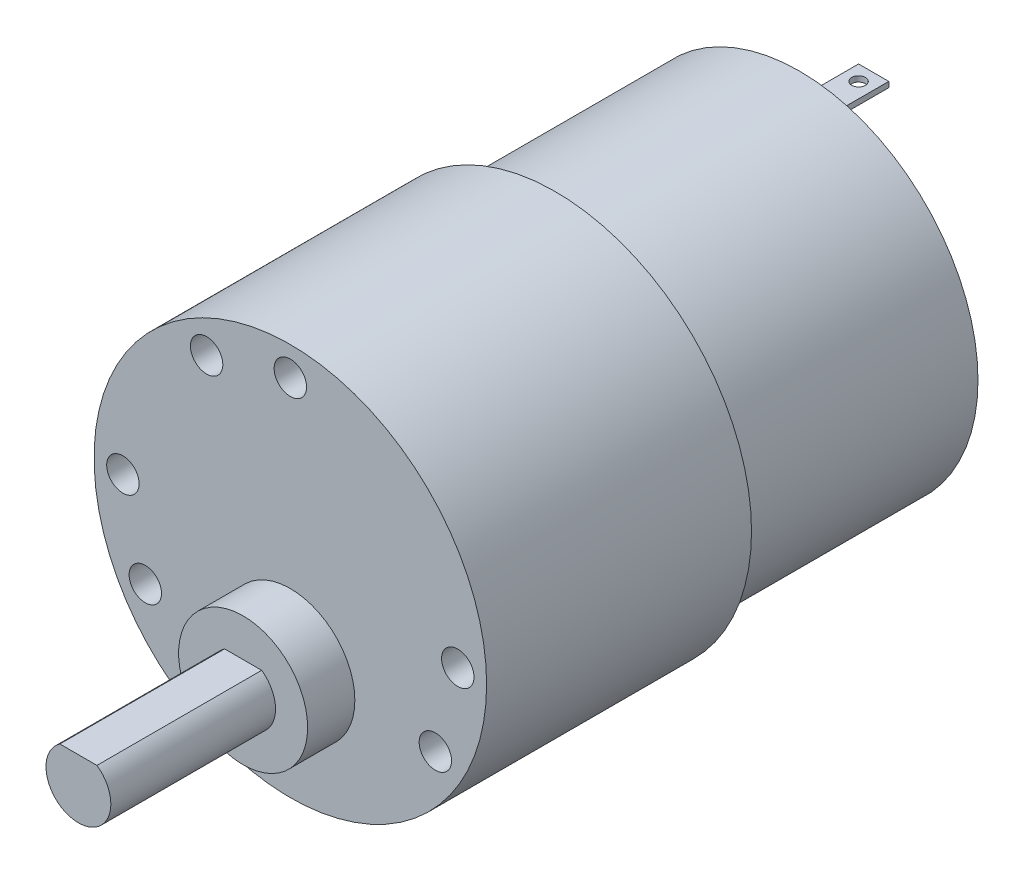
ISO-10303-21;
HEADER;
FILE_DESCRIPTION(('STEP AP214'),'2;1');
FILE_NAME('part.step','',(''),(''),'','','');
FILE_SCHEMA(('AUTOMOTIVE_DESIGN { 1 0 10303 214 1 1 1 1 }'));
ENDSEC;
DATA;
#1=APPLICATION_CONTEXT('core data for automotive mechanical design processes');
#2=APPLICATION_PROTOCOL_DEFINITION('international standard','automotive_design',2000,#1);
#3=PRODUCT_CONTEXT('',#1,'mechanical');
#4=PRODUCT('Part','Part','',(#3));
#5=PRODUCT_RELATED_PRODUCT_CATEGORY('part','',(#4));
#6=PRODUCT_DEFINITION_FORMATION('','',#4);
#7=PRODUCT_DEFINITION_CONTEXT('part definition',#1,'design');
#8=PRODUCT_DEFINITION('design','',#6,#7);
#9=PRODUCT_DEFINITION_SHAPE('','',#8);
#10=(LENGTH_UNIT() NAMED_UNIT(*) SI_UNIT(.MILLI.,.METRE.));
#11=(NAMED_UNIT(*) PLANE_ANGLE_UNIT() SI_UNIT($,.RADIAN.));
#12=(NAMED_UNIT(*) SI_UNIT($,.STERADIAN.) SOLID_ANGLE_UNIT());
#13=UNCERTAINTY_MEASURE_WITH_UNIT(LENGTH_MEASURE(1.E-05),#10,'distance_accuracy_value','');
#14=(GEOMETRIC_REPRESENTATION_CONTEXT(3) GLOBAL_UNCERTAINTY_ASSIGNED_CONTEXT((#13)) GLOBAL_UNIT_ASSIGNED_CONTEXT((#10,
#11,#12)) REPRESENTATION_CONTEXT('',''));
#15=CARTESIAN_POINT('',(0.,0.,0.));
#16=DIRECTION('',(0.,0.,1.));
#17=DIRECTION('',(1.,0.,0.));
#18=AXIS2_PLACEMENT_3D('',#15,#16,#17);
#19=CARTESIAN_POINT('',(0.,-12.7,-23.876));
#20=DIRECTION('',(0.,0.,-1.));
#21=DIRECTION('',(-1.,0.,0.));
#22=AXIS2_PLACEMENT_3D('',#19,#20,#21);
#23=PLANE('',#22);
#24=CARTESIAN_POINT('',(0.,-12.7,-23.876));
#25=DIRECTION('',(0.,0.,-1.));
#26=DIRECTION('',(-1.,0.,0.));
#27=AXIS2_PLACEMENT_3D('',#24,#25,#26);
#28=CIRCLE('',#27,2.413);
#29=CARTESIAN_POINT('',(-2.413,-12.7,-23.876));
#30=VERTEX_POINT('',#29);
#31=EDGE_CURVE('E278',#30,#30,#28,.T.);
#32=ORIENTED_EDGE('',*,*,#31,.T.);
#33=EDGE_LOOP('',(#32));
#34=FACE_BOUND('',#33,.T.);
#35=DIRECTION('',(-1.,0.,0.));
#36=VECTOR('',#35,1.);
#37=CARTESIAN_POINT('',(-1.397,-12.446,-23.876));
#38=LINE('',#37,#36);
#39=CARTESIAN_POINT('',(1.397,-12.446,-23.876));
#40=VERTEX_POINT('',#39);
#41=CARTESIAN_POINT('',(-1.397,-12.446,-23.876));
#42=VERTEX_POINT('',#41);
#43=EDGE_CURVE('E48',#40,#42,#38,.T.);
#44=ORIENTED_EDGE('',*,*,#43,.T.);
#45=DIRECTION('',(0.,1.,0.));
#46=VECTOR('',#45,1.);
#47=CARTESIAN_POINT('',(-1.397,-12.954,-23.876));
#48=LINE('',#47,#46);
#49=CARTESIAN_POINT('',(-1.397,-12.954,-23.876));
#50=VERTEX_POINT('',#49);
#51=EDGE_CURVE('E213',#50,#42,#48,.T.);
#52=ORIENTED_EDGE('',*,*,#51,.F.);
#53=DIRECTION('',(-1.,0.,0.));
#54=VECTOR('',#53,1.);
#55=CARTESIAN_POINT('',(-1.397,-12.954,-23.876));
#56=LINE('',#55,#54);
#57=CARTESIAN_POINT('',(1.397,-12.954,-23.876));
#58=VERTEX_POINT('',#57);
#59=EDGE_CURVE('E188',#58,#50,#56,.T.);
#60=ORIENTED_EDGE('',*,*,#59,.F.);
#61=DIRECTION('',(0.,1.,0.));
#62=VECTOR('',#61,1.);
#63=CARTESIAN_POINT('',(1.397,-12.954,-23.876));
#64=LINE('',#63,#62);
#65=EDGE_CURVE('E198',#58,#40,#64,.T.);
#66=ORIENTED_EDGE('',*,*,#65,.T.);
#67=EDGE_LOOP('',(#44,#52,#60,#66));
#68=FACE_BOUND('',#67,.T.);
#69=ADVANCED_FACE('F33',(#34,#68),#23,.T.);
#70=CARTESIAN_POINT('',(0.,12.7,-23.876));
#71=DIRECTION('',(0.,0.,-1.));
#72=DIRECTION('',(-1.,0.,0.));
#73=AXIS2_PLACEMENT_3D('',#70,#71,#72);
#74=PLANE('',#73);
#75=CARTESIAN_POINT('',(0.,12.7,-23.876));
#76=DIRECTION('',(0.,0.,-1.));
#77=DIRECTION('',(-1.,0.,0.));
#78=AXIS2_PLACEMENT_3D('',#75,#76,#77);
#79=CIRCLE('',#78,2.413);
#80=CARTESIAN_POINT('',(-2.413,12.7,-23.876));
#81=VERTEX_POINT('',#80);
#82=EDGE_CURVE('E272',#81,#81,#79,.T.);
#83=ORIENTED_EDGE('',*,*,#82,.T.);
#84=EDGE_LOOP('',(#83));
#85=FACE_BOUND('',#84,.T.);
#86=DIRECTION('',(1.,0.,0.));
#87=VECTOR('',#86,1.);
#88=CARTESIAN_POINT('',(1.397,12.446,-23.876));
#89=LINE('',#88,#87);
#90=CARTESIAN_POINT('',(-1.397,12.446,-23.876));
#91=VERTEX_POINT('',#90);
#92=CARTESIAN_POINT('',(1.397,12.446,-23.876));
#93=VERTEX_POINT('',#92);
#94=EDGE_CURVE('E56',#91,#93,#89,.T.);
#95=ORIENTED_EDGE('',*,*,#94,.T.);
#96=DIRECTION('',(0.,-1.,0.));
#97=VECTOR('',#96,1.);
#98=CARTESIAN_POINT('',(1.397,12.954,-23.876));
#99=LINE('',#98,#97);
#100=CARTESIAN_POINT('',(1.397,12.954,-23.876));
#101=VERTEX_POINT('',#100);
#102=EDGE_CURVE('E247',#101,#93,#99,.T.);
#103=ORIENTED_EDGE('',*,*,#102,.F.);
#104=DIRECTION('',(1.,0.,0.));
#105=VECTOR('',#104,1.);
#106=CARTESIAN_POINT('',(1.397,12.954,-23.876));
#107=LINE('',#106,#105);
#108=CARTESIAN_POINT('',(-1.397,12.954,-23.876));
#109=VERTEX_POINT('',#108);
#110=EDGE_CURVE('E222',#109,#101,#107,.T.);
#111=ORIENTED_EDGE('',*,*,#110,.F.);
#112=DIRECTION('',(0.,-1.,0.));
#113=VECTOR('',#112,1.);
#114=CARTESIAN_POINT('',(-1.397,12.954,-23.876));
#115=LINE('',#114,#113);
#116=EDGE_CURVE('E232',#109,#91,#115,.T.);
#117=ORIENTED_EDGE('',*,*,#116,.T.);
#118=EDGE_LOOP('',(#95,#103,#111,#117));
#119=FACE_BOUND('',#118,.T.);
#120=ADVANCED_FACE('F321',(#85,#119),#74,.T.);
#121=CARTESIAN_POINT('',(0.,-7.366,28.8798));
#122=DIRECTION('',(0.,0.,1.));
#123=DIRECTION('',(1.,0.,0.));
#124=AXIS2_PLACEMENT_3D('',#121,#122,#123);
#125=PLANE('',#124);
#126=CARTESIAN_POINT('',(0.,-7.366,28.8798));
#127=DIRECTION('',(0.,0.,1.));
#128=DIRECTION('',(1.,0.,0.));
#129=AXIS2_PLACEMENT_3D('',#126,#127,#128);
#130=CIRCLE('',#129,5.969);
#131=CARTESIAN_POINT('',(5.969,-7.366,28.8798));
#132=VERTEX_POINT('',#131);
#133=EDGE_CURVE('E266',#132,#132,#130,.T.);
#134=ORIENTED_EDGE('',*,*,#133,.T.);
#135=EDGE_LOOP('',(#134));
#136=FACE_BOUND('',#135,.T.);
#137=DIRECTION('',(-1.,0.,0.));
#138=VECTOR('',#137,1.);
#139=CARTESIAN_POINT('',(-1.71565701700544,-4.905,28.8798));
#140=LINE('',#139,#138);
#141=CARTESIAN_POINT('',(1.71565701700544,-4.905,28.8798));
#142=VERTEX_POINT('',#141);
#143=CARTESIAN_POINT('',(-1.71565701700544,-4.905,28.8798));
#144=VERTEX_POINT('',#143);
#145=EDGE_CURVE('E255',#142,#144,#140,.T.);
#146=ORIENTED_EDGE('',*,*,#145,.F.);
#147=CARTESIAN_POINT('',(0.,-7.366,28.8798));
#148=DIRECTION('',(0.,0.,1.));
#149=DIRECTION('',(1.,0.,0.));
#150=AXIS2_PLACEMENT_3D('',#147,#148,#149);
#151=CIRCLE('',#150,3.);
#152=EDGE_CURVE('E250',#144,#142,#151,.T.);
#153=ORIENTED_EDGE('',*,*,#152,.F.);
#154=EDGE_LOOP('',(#146,#153));
#155=FACE_BOUND('',#154,.T.);
#156=ADVANCED_FACE('F327',(#136,#155),#125,.T.);
#157=CARTESIAN_POINT('',(0.,0.,24.511));
#158=DIRECTION('',(0.,0.,1.));
#159=DIRECTION('',(1.,0.,0.));
#160=AXIS2_PLACEMENT_3D('',#157,#158,#159);
#161=PLANE('',#160);
#162=CARTESIAN_POINT('',(-7.74699999999983,13.4181976062362,24.511));
#163=DIRECTION('',(0.,0.,1.));
#164=DIRECTION('',(1.,0.,0.));
#165=AXIS2_PLACEMENT_3D('',#162,#163,#164);
#166=CIRCLE('',#165,1.49999999999999);
#167=CARTESIAN_POINT('',(-6.24699999999984,13.4181976062362,24.511));
#168=VERTEX_POINT('',#167);
#169=EDGE_CURVE('E142',#168,#168,#166,.T.);
#170=ORIENTED_EDGE('',*,*,#169,.F.);
#171=EDGE_LOOP('',(#170));
#172=FACE_BOUND('',#171,.T.);
#173=CARTESIAN_POINT('',(-15.494,1.62291035592107E-13,24.511));
#174=DIRECTION('',(0.,0.,1.));
#175=DIRECTION('',(1.,0.,0.));
#176=AXIS2_PLACEMENT_3D('',#173,#174,#175);
#177=CIRCLE('',#176,1.49999999999999);
#178=CARTESIAN_POINT('',(-13.994,1.62291035592107E-13,24.511));
#179=VERTEX_POINT('',#178);
#180=EDGE_CURVE('E141',#179,#179,#177,.T.);
#181=ORIENTED_EDGE('',*,*,#180,.F.);
#182=EDGE_LOOP('',(#181));
#183=FACE_BOUND('',#182,.T.);
#184=CARTESIAN_POINT('',(-13.4181976062362,-7.74699999999987,24.511));
#185=DIRECTION('',(0.,0.,1.));
#186=DIRECTION('',(1.,0.,0.));
#187=AXIS2_PLACEMENT_3D('',#184,#185,#186);
#188=CIRCLE('',#187,1.49999999999999);
#189=CARTESIAN_POINT('',(-11.9181976062362,-7.74699999999987,24.511));
#190=VERTEX_POINT('',#189);
#191=EDGE_CURVE('E152',#190,#190,#188,.T.);
#192=ORIENTED_EDGE('',*,*,#191,.F.);
#193=EDGE_LOOP('',(#192));
#194=FACE_BOUND('',#193,.T.);
#195=CARTESIAN_POINT('',(-7.74700000000011,-13.418197606236,24.511));
#196=DIRECTION('',(0.,0.,1.));
#197=DIRECTION('',(1.,0.,0.));
#198=AXIS2_PLACEMENT_3D('',#195,#196,#197);
#199=CIRCLE('',#198,1.49999999999999);
#200=CARTESIAN_POINT('',(-6.24700000000012,-13.418197606236,24.511));
#201=VERTEX_POINT('',#200);
#202=EDGE_CURVE('E158',#201,#201,#199,.T.);
#203=ORIENTED_EDGE('',*,*,#202,.F.);
#204=EDGE_LOOP('',(#203));
#205=FACE_BOUND('',#204,.T.);
#206=CARTESIAN_POINT('',(13.4181976062361,-7.74700000000006,24.511));
#207=DIRECTION('',(0.,0.,1.));
#208=DIRECTION('',(1.,0.,0.));
#209=AXIS2_PLACEMENT_3D('',#206,#207,#208);
#210=CIRCLE('',#209,1.49999999999999);
#211=CARTESIAN_POINT('',(14.918197606236,-7.74700000000006,24.511));
#212=VERTEX_POINT('',#211);
#213=EDGE_CURVE('E164',#212,#212,#210,.T.);
#214=ORIENTED_EDGE('',*,*,#213,.F.);
#215=EDGE_LOOP('',(#214));
#216=FACE_BOUND('',#215,.T.);
#217=CARTESIAN_POINT('',(15.494,0.,24.511));
#218=DIRECTION('',(0.,0.,1.));
#219=DIRECTION('',(1.,0.,0.));
#220=AXIS2_PLACEMENT_3D('',#217,#218,#219);
#221=CIRCLE('',#220,1.49999999999999);
#222=CARTESIAN_POINT('',(16.994,0.,24.511));
#223=VERTEX_POINT('',#222);
#224=EDGE_CURVE('E170',#223,#223,#221,.T.);
#225=ORIENTED_EDGE('',*,*,#224,.F.);
#226=EDGE_LOOP('',(#225));
#227=FACE_BOUND('',#226,.T.);
#228=CARTESIAN_POINT('',(0.,15.494,24.511));
#229=DIRECTION('',(0.,0.,1.));
#230=DIRECTION('',(1.,0.,0.));
#231=AXIS2_PLACEMENT_3D('',#228,#229,#230);
#232=CIRCLE('',#231,1.49999999999999);
#233=CARTESIAN_POINT('',(1.49999999999999,15.494,24.511));
#234=VERTEX_POINT('',#233);
#235=EDGE_CURVE('E176',#234,#234,#232,.T.);
#236=ORIENTED_EDGE('',*,*,#235,.F.);
#237=EDGE_LOOP('',(#236));
#238=FACE_BOUND('',#237,.T.);
#239=CARTESIAN_POINT('',(0.,0.,24.511));
#240=DIRECTION('',(0.,0.,1.));
#241=DIRECTION('',(1.,0.,0.));
#242=AXIS2_PLACEMENT_3D('',#239,#240,#241);
#243=CIRCLE('',#242,18.161);
#244=CARTESIAN_POINT('',(18.161,0.,24.511));
#245=VERTEX_POINT('',#244);
#246=EDGE_CURVE('E41',#245,#245,#243,.T.);
#247=ORIENTED_EDGE('',*,*,#246,.T.);
#248=EDGE_LOOP('',(#247));
#249=FACE_BOUND('',#248,.T.);
#250=CARTESIAN_POINT('',(0.,-7.366,24.511));
#251=DIRECTION('',(0.,0.,1.));
#252=DIRECTION('',(1.,0.,0.));
#253=AXIS2_PLACEMENT_3D('',#250,#251,#252);
#254=CIRCLE('',#253,5.969);
#255=CARTESIAN_POINT('',(5.969,-7.366,24.511));
#256=VERTEX_POINT('',#255);
#257=EDGE_CURVE('E265',#256,#256,#254,.T.);
#258=ORIENTED_EDGE('',*,*,#257,.F.);
#259=EDGE_LOOP('',(#258));
#260=FACE_BOUND('',#259,.T.);
#261=ADVANCED_FACE('F341',(#172,#183,#194,#205,#216,#227,#238,#249,#260),#161,.T.);
#262=CARTESIAN_POINT('',(0.,0.,-22.606));
#263=DIRECTION('',(0.,0.,-1.));
#264=DIRECTION('',(-1.,0.,0.));
#265=AXIS2_PLACEMENT_3D('',#262,#263,#264);
#266=PLANE('',#265);
#267=CARTESIAN_POINT('',(0.,-12.7,-22.606));
#268=DIRECTION('',(0.,0.,-1.));
#269=DIRECTION('',(-1.,0.,0.));
#270=AXIS2_PLACEMENT_3D('',#267,#268,#269);
#271=CIRCLE('',#270,2.413);
#272=CARTESIAN_POINT('',(-2.413,-12.7,-22.606));
#273=VERTEX_POINT('',#272);
#274=EDGE_CURVE('E275',#273,#273,#271,.T.);
#275=ORIENTED_EDGE('',*,*,#274,.F.);
#276=EDGE_LOOP('',(#275));
#277=FACE_BOUND('',#276,.T.);
#278=CARTESIAN_POINT('',(0.,0.,-22.606));
#279=DIRECTION('',(0.,0.,-1.));
#280=DIRECTION('',(-1.,0.,0.));
#281=AXIS2_PLACEMENT_3D('',#278,#279,#280);
#282=CIRCLE('',#281,16.51);
#283=CARTESIAN_POINT('',(-16.51,0.,-22.606));
#284=VERTEX_POINT('',#283);
#285=EDGE_CURVE('E287',#284,#284,#282,.T.);
#286=ORIENTED_EDGE('',*,*,#285,.T.);
#287=EDGE_LOOP('',(#286));
#288=FACE_BOUND('',#287,.T.);
#289=CARTESIAN_POINT('',(0.,0.,-22.606));
#290=DIRECTION('',(0.,0.,-1.));
#291=DIRECTION('',(-1.,0.,0.));
#292=AXIS2_PLACEMENT_3D('',#289,#290,#291);
#293=CIRCLE('',#292,4.5085);
#294=CARTESIAN_POINT('',(-4.5085,0.,-22.606));
#295=VERTEX_POINT('',#294);
#296=EDGE_CURVE('E281',#295,#295,#293,.T.);
#297=ORIENTED_EDGE('',*,*,#296,.F.);
#298=EDGE_LOOP('',(#297));
#299=FACE_BOUND('',#298,.T.);
#300=CARTESIAN_POINT('',(0.,12.7,-22.606));
#301=DIRECTION('',(0.,0.,-1.));
#302=DIRECTION('',(-1.,0.,0.));
#303=AXIS2_PLACEMENT_3D('',#300,#301,#302);
#304=CIRCLE('',#303,2.413);
#305=CARTESIAN_POINT('',(-2.413,12.7,-22.606));
#306=VERTEX_POINT('',#305);
#307=EDGE_CURVE('E269',#306,#306,#304,.T.);
#308=ORIENTED_EDGE('',*,*,#307,.F.);
#309=EDGE_LOOP('',(#308));
#310=FACE_BOUND('',#309,.T.);
#311=ADVANCED_FACE('F301',(#277,#288,#299,#310),#266,.T.);
#312=CARTESIAN_POINT('',(0.,0.,0.));
#313=DIRECTION('',(0.,0.,1.));
#314=DIRECTION('',(1.,0.,0.));
#315=AXIS2_PLACEMENT_3D('',#312,#313,#314);
#316=PLANE('',#315);
#317=CARTESIAN_POINT('',(0.,0.,0.));
#318=DIRECTION('',(0.,0.,1.));
#319=DIRECTION('',(1.,0.,0.));
#320=AXIS2_PLACEMENT_3D('',#317,#318,#319);
#321=CIRCLE('',#320,18.161);
#322=CARTESIAN_POINT('',(18.161,0.,0.));
#323=VERTEX_POINT('',#322);
#324=EDGE_CURVE('E292',#323,#323,#321,.T.);
#325=ORIENTED_EDGE('',*,*,#324,.F.);
#326=EDGE_LOOP('',(#325));
#327=FACE_BOUND('',#326,.T.);
#328=CARTESIAN_POINT('',(0.,0.,0.));
#329=DIRECTION('',(0.,0.,1.));
#330=DIRECTION('',(1.,0.,0.));
#331=AXIS2_PLACEMENT_3D('',#328,#329,#330);
#332=CIRCLE('',#331,16.51);
#333=CARTESIAN_POINT('',(16.51,0.,0.));
#334=VERTEX_POINT('',#333);
#335=EDGE_CURVE('E11',#334,#334,#332,.F.);
#336=ORIENTED_EDGE('',*,*,#335,.F.);
#337=EDGE_LOOP('',(#336));
#338=FACE_BOUND('',#337,.T.);
#339=ADVANCED_FACE('F298',(#327,#338),#316,.F.);
#340=CARTESIAN_POINT('',(0.,0.,24.511));
#341=DIRECTION('',(0.,0.,-1.));
#342=DIRECTION('',(-1.,0.,0.));
#343=AXIS2_PLACEMENT_3D('',#340,#341,#342);
#344=CYLINDRICAL_SURFACE('',#343,18.161);
#345=ORIENTED_EDGE('',*,*,#246,.F.);
#346=EDGE_LOOP('',(#345));
#347=FACE_BOUND('',#346,.T.);
#348=ORIENTED_EDGE('',*,*,#324,.T.);
#349=EDGE_LOOP('',(#348));
#350=FACE_BOUND('',#349,.T.);
#351=ADVANCED_FACE('F35',(#347,#350),#344,.T.);
#352=CARTESIAN_POINT('',(0.,0.,-22.606));
#353=DIRECTION('',(0.,0.,1.));
#354=DIRECTION('',(1.,0.,0.));
#355=AXIS2_PLACEMENT_3D('',#352,#353,#354);
#356=CYLINDRICAL_SURFACE('',#355,16.51);
#357=ORIENTED_EDGE('',*,*,#285,.F.);
#358=EDGE_LOOP('',(#357));
#359=FACE_BOUND('',#358,.T.);
#360=ORIENTED_EDGE('',*,*,#335,.T.);
#361=EDGE_LOOP('',(#360));
#362=FACE_BOUND('',#361,.T.);
#363=ADVANCED_FACE('F304',(#359,#362),#356,.T.);
#364=CARTESIAN_POINT('',(0.,0.,-25.908));
#365=DIRECTION('',(0.,0.,1.));
#366=DIRECTION('',(1.,0.,0.));
#367=AXIS2_PLACEMENT_3D('',#364,#365,#366);
#368=CYLINDRICAL_SURFACE('',#367,4.5085);
#369=CARTESIAN_POINT('',(0.,0.,-25.908));
#370=DIRECTION('',(0.,0.,-1.));
#371=DIRECTION('',(-1.,0.,0.));
#372=AXIS2_PLACEMENT_3D('',#369,#370,#371);
#373=CIRCLE('',#372,4.5085);
#374=CARTESIAN_POINT('',(-4.5085,0.,-25.908));
#375=VERTEX_POINT('',#374);
#376=EDGE_CURVE('E284',#375,#375,#373,.T.);
#377=ORIENTED_EDGE('',*,*,#376,.F.);
#378=EDGE_LOOP('',(#377));
#379=FACE_BOUND('',#378,.T.);
#380=ORIENTED_EDGE('',*,*,#296,.T.);
#381=EDGE_LOOP('',(#380));
#382=FACE_BOUND('',#381,.T.);
#383=ADVANCED_FACE('F306',(#379,#382),#368,.T.);
#384=CARTESIAN_POINT('',(0.,0.,-25.908));
#385=DIRECTION('',(0.,0.,-1.));
#386=DIRECTION('',(-1.,0.,0.));
#387=AXIS2_PLACEMENT_3D('',#384,#385,#386);
#388=PLANE('',#387);
#389=ORIENTED_EDGE('',*,*,#376,.T.);
#390=EDGE_LOOP('',(#389));
#391=FACE_BOUND('',#390,.T.);
#392=ADVANCED_FACE('F313',(#391),#388,.T.);
#393=CARTESIAN_POINT('',(0.,-12.7,-23.876));
#394=DIRECTION('',(0.,0.,1.));
#395=DIRECTION('',(1.,0.,0.));
#396=AXIS2_PLACEMENT_3D('',#393,#394,#395);
#397=CYLINDRICAL_SURFACE('',#396,2.413);
#398=ORIENTED_EDGE('',*,*,#31,.F.);
#399=EDGE_LOOP('',(#398));
#400=FACE_BOUND('',#399,.T.);
#401=ORIENTED_EDGE('',*,*,#274,.T.);
#402=EDGE_LOOP('',(#401));
#403=FACE_BOUND('',#402,.T.);
#404=ADVANCED_FACE('F334',(#400,#403),#397,.T.);
#405=CARTESIAN_POINT('',(0.,12.7,-23.876));
#406=DIRECTION('',(0.,0.,1.));
#407=DIRECTION('',(1.,0.,0.));
#408=AXIS2_PLACEMENT_3D('',#405,#406,#407);
#409=CYLINDRICAL_SURFACE('',#408,2.413);
#410=ORIENTED_EDGE('',*,*,#82,.F.);
#411=EDGE_LOOP('',(#410));
#412=FACE_BOUND('',#411,.T.);
#413=ORIENTED_EDGE('',*,*,#307,.T.);
#414=EDGE_LOOP('',(#413));
#415=FACE_BOUND('',#414,.T.);
#416=ADVANCED_FACE('F333',(#412,#415),#409,.T.);
#417=CARTESIAN_POINT('',(0.,-7.366,28.8798));
#418=DIRECTION('',(0.,0.,-1.));
#419=DIRECTION('',(-1.,0.,0.));
#420=AXIS2_PLACEMENT_3D('',#417,#418,#419);
#421=CYLINDRICAL_SURFACE('',#420,5.969);
#422=ORIENTED_EDGE('',*,*,#133,.F.);
#423=EDGE_LOOP('',(#422));
#424=FACE_BOUND('',#423,.T.);
#425=ORIENTED_EDGE('',*,*,#257,.T.);
#426=EDGE_LOOP('',(#425));
#427=FACE_BOUND('',#426,.T.);
#428=ADVANCED_FACE('F355',(#424,#427),#421,.T.);
#429=CARTESIAN_POINT('',(0.,-7.366,44.1198));
#430=DIRECTION('',(0.,0.,-1.));
#431=DIRECTION('',(-1.,0.,0.));
#432=AXIS2_PLACEMENT_3D('',#429,#430,#431);
#433=CYLINDRICAL_SURFACE('',#432,3.);
#434=ORIENTED_EDGE('',*,*,#152,.T.);
#435=DIRECTION('',(0.,0.,-1.));
#436=VECTOR('',#435,1.);
#437=CARTESIAN_POINT('',(1.71565701700544,-4.905,44.1198));
#438=LINE('',#437,#436);
#439=CARTESIAN_POINT('',(1.71565701700544,-4.905,44.1198));
#440=VERTEX_POINT('',#439);
#441=EDGE_CURVE('E262',#440,#142,#438,.T.);
#442=ORIENTED_EDGE('',*,*,#441,.F.);
#443=CARTESIAN_POINT('',(0.,-7.366,44.1198));
#444=DIRECTION('',(0.,0.,1.));
#445=DIRECTION('',(1.,0.,0.));
#446=AXIS2_PLACEMENT_3D('',#443,#444,#445);
#447=CIRCLE('',#446,3.);
#448=CARTESIAN_POINT('',(-1.71565701700544,-4.905,44.1198));
#449=VERTEX_POINT('',#448);
#450=EDGE_CURVE('E251',#449,#440,#447,.T.);
#451=ORIENTED_EDGE('',*,*,#450,.F.);
#452=DIRECTION('',(0.,0.,-1.));
#453=VECTOR('',#452,1.);
#454=CARTESIAN_POINT('',(-1.71565701700544,-4.905,44.1198));
#455=LINE('',#454,#453);
#456=EDGE_CURVE('E257',#449,#144,#455,.T.);
#457=ORIENTED_EDGE('',*,*,#456,.T.);
#458=EDGE_LOOP('',(#434,#442,#451,#457));
#459=FACE_BOUND('',#458,.T.);
#460=ADVANCED_FACE('F360',(#459),#433,.T.);
#461=CARTESIAN_POINT('',(-1.71565701700544,-4.905,44.1198));
#462=DIRECTION('',(0.,-1.,0.));
#463=DIRECTION('',(0.,0.,-1.));
#464=AXIS2_PLACEMENT_3D('',#461,#462,#463);
#465=PLANE('',#464);
#466=ORIENTED_EDGE('',*,*,#145,.T.);
#467=ORIENTED_EDGE('',*,*,#456,.F.);
#468=DIRECTION('',(-1.,0.,0.));
#469=VECTOR('',#468,1.);
#470=CARTESIAN_POINT('',(-1.71565701700544,-4.905,44.1198));
#471=LINE('',#470,#469);
#472=EDGE_CURVE('E254',#440,#449,#471,.T.);
#473=ORIENTED_EDGE('',*,*,#472,.F.);
#474=ORIENTED_EDGE('',*,*,#441,.T.);
#475=EDGE_LOOP('',(#466,#467,#473,#474));
#476=FACE_BOUND('',#475,.T.);
#477=ADVANCED_FACE('F408',(#476),#465,.F.);
#478=CARTESIAN_POINT('',(0.,-7.366,44.1198));
#479=DIRECTION('',(0.,0.,1.));
#480=DIRECTION('',(1.,0.,0.));
#481=AXIS2_PLACEMENT_3D('',#478,#479,#480);
#482=PLANE('',#481);
#483=ORIENTED_EDGE('',*,*,#450,.T.);
#484=ORIENTED_EDGE('',*,*,#472,.T.);
#485=EDGE_LOOP('',(#483,#484));
#486=FACE_BOUND('',#485,.T.);
#487=ADVANCED_FACE('F385',(#486),#482,.T.);
#488=CARTESIAN_POINT('',(0.,12.954,0.));
#489=DIRECTION('',(0.,-1.,0.));
#490=DIRECTION('',(0.,0.,-1.));
#491=AXIS2_PLACEMENT_3D('',#488,#489,#490);
#492=PLANE('',#491);
#493=ORIENTED_EDGE('',*,*,#110,.T.);
#494=DIRECTION('',(0.,0.,-1.));
#495=VECTOR('',#494,1.);
#496=CARTESIAN_POINT('',(1.397,12.954,-23.876));
#497=LINE('',#496,#495);
#498=CARTESIAN_POINT('',(1.397,12.954,-29.464));
#499=VERTEX_POINT('',#498);
#500=EDGE_CURVE('E225',#101,#499,#497,.T.);
#501=ORIENTED_EDGE('',*,*,#500,.T.);
#502=DIRECTION('',(-1.,0.,0.));
#503=VECTOR('',#502,1.);
#504=CARTESIAN_POINT('',(1.397,12.954,-29.464));
#505=LINE('',#504,#503);
#506=CARTESIAN_POINT('',(-1.397,12.954,-29.464));
#507=VERTEX_POINT('',#506);
#508=EDGE_CURVE('E228',#499,#507,#505,.T.);
#509=ORIENTED_EDGE('',*,*,#508,.T.);
#510=DIRECTION('',(0.,0.,1.));
#511=VECTOR('',#510,1.);
#512=CARTESIAN_POINT('',(-1.397,12.954,-23.876));
#513=LINE('',#512,#511);
#514=EDGE_CURVE('E230',#507,#109,#513,.T.);
#515=ORIENTED_EDGE('',*,*,#514,.T.);
#516=EDGE_LOOP('',(#493,#501,#509,#515));
#517=FACE_BOUND('',#516,.T.);
#518=CARTESIAN_POINT('',(0.,12.954,-28.067));
#519=DIRECTION('',(0.,1.,0.));
#520=DIRECTION('',(0.,0.,1.));
#521=AXIS2_PLACEMENT_3D('',#518,#519,#520);
#522=CIRCLE('',#521,0.634999999999999);
#523=CARTESIAN_POINT('',(0.,12.954,-27.432));
#524=VERTEX_POINT('',#523);
#525=EDGE_CURVE('E217',#524,#524,#522,.T.);
#526=ORIENTED_EDGE('',*,*,#525,.F.);
#527=EDGE_LOOP('',(#526));
#528=FACE_BOUND('',#527,.T.);
#529=ADVANCED_FACE('F382',(#517,#528),#492,.F.);
#530=CARTESIAN_POINT('',(0.,12.446,0.));
#531=DIRECTION('',(0.,-1.,0.));
#532=DIRECTION('',(0.,0.,-1.));
#533=AXIS2_PLACEMENT_3D('',#530,#531,#532);
#534=PLANE('',#533);
#535=ORIENTED_EDGE('',*,*,#94,.F.);
#536=DIRECTION('',(0.,0.,1.));
#537=VECTOR('',#536,1.);
#538=CARTESIAN_POINT('',(-1.397,12.446,-23.876));
#539=LINE('',#538,#537);
#540=CARTESIAN_POINT('',(-1.397,12.446,-29.464));
#541=VERTEX_POINT('',#540);
#542=EDGE_CURVE('E226',#541,#91,#539,.T.);
#543=ORIENTED_EDGE('',*,*,#542,.F.);
#544=DIRECTION('',(-1.,0.,0.));
#545=VECTOR('',#544,1.);
#546=CARTESIAN_POINT('',(1.397,12.446,-29.464));
#547=LINE('',#546,#545);
#548=CARTESIAN_POINT('',(1.397,12.446,-29.464));
#549=VERTEX_POINT('',#548);
#550=EDGE_CURVE('E236',#549,#541,#547,.T.);
#551=ORIENTED_EDGE('',*,*,#550,.F.);
#552=DIRECTION('',(0.,0.,-1.));
#553=VECTOR('',#552,1.);
#554=CARTESIAN_POINT('',(1.397,12.446,-23.876));
#555=LINE('',#554,#553);
#556=EDGE_CURVE('E234',#93,#549,#555,.T.);
#557=ORIENTED_EDGE('',*,*,#556,.F.);
#558=EDGE_LOOP('',(#535,#543,#551,#557));
#559=FACE_BOUND('',#558,.T.);
#560=CARTESIAN_POINT('',(0.,12.446,-28.067));
#561=DIRECTION('',(0.,1.,0.));
#562=DIRECTION('',(0.,0.,1.));
#563=AXIS2_PLACEMENT_3D('',#560,#561,#562);
#564=CIRCLE('',#563,0.634999999999999);
#565=CARTESIAN_POINT('',(0.,12.446,-27.432));
#566=VERTEX_POINT('',#565);
#567=EDGE_CURVE('E216',#566,#566,#564,.T.);
#568=ORIENTED_EDGE('',*,*,#567,.T.);
#569=EDGE_LOOP('',(#568));
#570=FACE_BOUND('',#569,.T.);
#571=ADVANCED_FACE('F373',(#559,#570),#534,.T.);
#572=CARTESIAN_POINT('',(1.397,12.954,-23.876));
#573=DIRECTION('',(-1.,0.,0.));
#574=DIRECTION('',(0.,0.,1.));
#575=AXIS2_PLACEMENT_3D('',#572,#573,#574);
#576=PLANE('',#575);
#577=ORIENTED_EDGE('',*,*,#556,.T.);
#578=DIRECTION('',(0.,-1.,0.));
#579=VECTOR('',#578,1.);
#580=CARTESIAN_POINT('',(1.397,12.954,-29.464));
#581=LINE('',#580,#579);
#582=EDGE_CURVE('E244',#499,#549,#581,.T.);
#583=ORIENTED_EDGE('',*,*,#582,.F.);
#584=ORIENTED_EDGE('',*,*,#500,.F.);
#585=ORIENTED_EDGE('',*,*,#102,.T.);
#586=EDGE_LOOP('',(#577,#583,#584,#585));
#587=FACE_BOUND('',#586,.T.);
#588=ADVANCED_FACE('F380',(#587),#576,.F.);
#589=CARTESIAN_POINT('',(1.397,12.954,-29.464));
#590=DIRECTION('',(0.,0.,1.));
#591=DIRECTION('',(1.,0.,0.));
#592=AXIS2_PLACEMENT_3D('',#589,#590,#591);
#593=PLANE('',#592);
#594=ORIENTED_EDGE('',*,*,#550,.T.);
#595=DIRECTION('',(0.,-1.,0.));
#596=VECTOR('',#595,1.);
#597=CARTESIAN_POINT('',(-1.397,12.954,-29.464));
#598=LINE('',#597,#596);
#599=EDGE_CURVE('E241',#507,#541,#598,.T.);
#600=ORIENTED_EDGE('',*,*,#599,.F.);
#601=ORIENTED_EDGE('',*,*,#508,.F.);
#602=ORIENTED_EDGE('',*,*,#582,.T.);
#603=EDGE_LOOP('',(#594,#600,#601,#602));
#604=FACE_BOUND('',#603,.T.);
#605=ADVANCED_FACE('F376',(#604),#593,.F.);
#606=CARTESIAN_POINT('',(-1.397,12.954,-23.876));
#607=DIRECTION('',(1.,0.,0.));
#608=DIRECTION('',(0.,0.,-1.));
#609=AXIS2_PLACEMENT_3D('',#606,#607,#608);
#610=PLANE('',#609);
#611=ORIENTED_EDGE('',*,*,#542,.T.);
#612=ORIENTED_EDGE('',*,*,#116,.F.);
#613=ORIENTED_EDGE('',*,*,#514,.F.);
#614=ORIENTED_EDGE('',*,*,#599,.T.);
#615=EDGE_LOOP('',(#611,#612,#613,#614));
#616=FACE_BOUND('',#615,.T.);
#617=ADVANCED_FACE('F370',(#616),#610,.F.);
#618=CARTESIAN_POINT('',(0.,12.954,-28.067));
#619=DIRECTION('',(0.,-1.,0.));
#620=DIRECTION('',(0.,0.,-1.));
#621=AXIS2_PLACEMENT_3D('',#618,#619,#620);
#622=CYLINDRICAL_SURFACE('',#621,0.634999999999999);
#623=ORIENTED_EDGE('',*,*,#525,.T.);
#624=EDGE_LOOP('',(#623));
#625=FACE_BOUND('',#624,.T.);
#626=ORIENTED_EDGE('',*,*,#567,.F.);
#627=EDGE_LOOP('',(#626));
#628=FACE_BOUND('',#627,.T.);
#629=ADVANCED_FACE('F389',(#625,#628),#622,.F.);
#630=CARTESIAN_POINT('',(0.,-12.954,0.));
#631=DIRECTION('',(0.,1.,0.));
#632=DIRECTION('',(0.,0.,-1.));
#633=AXIS2_PLACEMENT_3D('',#630,#631,#632);
#634=PLANE('',#633);
#635=ORIENTED_EDGE('',*,*,#59,.T.);
#636=DIRECTION('',(0.,0.,-1.));
#637=VECTOR('',#636,1.);
#638=CARTESIAN_POINT('',(-1.397,-12.954,-23.876));
#639=LINE('',#638,#637);
#640=CARTESIAN_POINT('',(-1.397,-12.954,-29.464));
#641=VERTEX_POINT('',#640);
#642=EDGE_CURVE('E191',#50,#641,#639,.T.);
#643=ORIENTED_EDGE('',*,*,#642,.T.);
#644=DIRECTION('',(1.,0.,0.));
#645=VECTOR('',#644,1.);
#646=CARTESIAN_POINT('',(-1.397,-12.954,-29.464));
#647=LINE('',#646,#645);
#648=CARTESIAN_POINT('',(1.397,-12.954,-29.464));
#649=VERTEX_POINT('',#648);
#650=EDGE_CURVE('E194',#641,#649,#647,.T.);
#651=ORIENTED_EDGE('',*,*,#650,.T.);
#652=DIRECTION('',(0.,0.,1.));
#653=VECTOR('',#652,1.);
#654=CARTESIAN_POINT('',(1.397,-12.954,-23.876));
#655=LINE('',#654,#653);
#656=EDGE_CURVE('E196',#649,#58,#655,.T.);
#657=ORIENTED_EDGE('',*,*,#656,.T.);
#658=EDGE_LOOP('',(#635,#643,#651,#657));
#659=FACE_BOUND('',#658,.T.);
#660=CARTESIAN_POINT('',(0.,-12.954,-28.067));
#661=DIRECTION('',(0.,-1.,0.));
#662=DIRECTION('',(0.,0.,1.));
#663=AXIS2_PLACEMENT_3D('',#660,#661,#662);
#664=CIRCLE('',#663,0.634999999999999);
#665=CARTESIAN_POINT('',(0.,-12.954,-27.432));
#666=VERTEX_POINT('',#665);
#667=EDGE_CURVE('E183',#666,#666,#664,.T.);
#668=ORIENTED_EDGE('',*,*,#667,.F.);
#669=EDGE_LOOP('',(#668));
#670=FACE_BOUND('',#669,.T.);
#671=ADVANCED_FACE('F392',(#659,#670),#634,.F.);
#672=CARTESIAN_POINT('',(0.,-12.446,0.));
#673=DIRECTION('',(0.,1.,0.));
#674=DIRECTION('',(0.,0.,-1.));
#675=AXIS2_PLACEMENT_3D('',#672,#673,#674);
#676=PLANE('',#675);
#677=ORIENTED_EDGE('',*,*,#43,.F.);
#678=DIRECTION('',(0.,0.,1.));
#679=VECTOR('',#678,1.);
#680=CARTESIAN_POINT('',(1.397,-12.446,-23.876));
#681=LINE('',#680,#679);
#682=CARTESIAN_POINT('',(1.397,-12.446,-29.464));
#683=VERTEX_POINT('',#682);
#684=EDGE_CURVE('E192',#683,#40,#681,.T.);
#685=ORIENTED_EDGE('',*,*,#684,.F.);
#686=DIRECTION('',(1.,0.,0.));
#687=VECTOR('',#686,1.);
#688=CARTESIAN_POINT('',(-1.397,-12.446,-29.464));
#689=LINE('',#688,#687);
#690=CARTESIAN_POINT('',(-1.397,-12.446,-29.464));
#691=VERTEX_POINT('',#690);
#692=EDGE_CURVE('E202',#691,#683,#689,.T.);
#693=ORIENTED_EDGE('',*,*,#692,.F.);
#694=DIRECTION('',(0.,0.,-1.));
#695=VECTOR('',#694,1.);
#696=CARTESIAN_POINT('',(-1.397,-12.446,-23.876));
#697=LINE('',#696,#695);
#698=EDGE_CURVE('E200',#42,#691,#697,.T.);
#699=ORIENTED_EDGE('',*,*,#698,.F.);
#700=EDGE_LOOP('',(#677,#685,#693,#699));
#701=FACE_BOUND('',#700,.T.);
#702=CARTESIAN_POINT('',(0.,-12.446,-28.067));
#703=DIRECTION('',(0.,-1.,0.));
#704=DIRECTION('',(0.,0.,1.));
#705=AXIS2_PLACEMENT_3D('',#702,#703,#704);
#706=CIRCLE('',#705,0.634999999999999);
#707=CARTESIAN_POINT('',(0.,-12.446,-27.432));
#708=VERTEX_POINT('',#707);
#709=EDGE_CURVE('E182',#708,#708,#706,.T.);
#710=ORIENTED_EDGE('',*,*,#709,.T.);
#711=EDGE_LOOP('',(#710));
#712=FACE_BOUND('',#711,.T.);
#713=ADVANCED_FACE('F578',(#701,#712),#676,.T.);
#714=CARTESIAN_POINT('',(-1.397,-12.954,-23.876));
#715=DIRECTION('',(1.,0.,0.));
#716=DIRECTION('',(0.,0.,-1.));
#717=AXIS2_PLACEMENT_3D('',#714,#715,#716);
#718=PLANE('',#717);
#719=ORIENTED_EDGE('',*,*,#698,.T.);
#720=DIRECTION('',(0.,1.,0.));
#721=VECTOR('',#720,1.);
#722=CARTESIAN_POINT('',(-1.397,-12.954,-29.464));
#723=LINE('',#722,#721);
#724=EDGE_CURVE('E210',#641,#691,#723,.T.);
#725=ORIENTED_EDGE('',*,*,#724,.F.);
#726=ORIENTED_EDGE('',*,*,#642,.F.);
#727=ORIENTED_EDGE('',*,*,#51,.T.);
#728=EDGE_LOOP('',(#719,#725,#726,#727));
#729=FACE_BOUND('',#728,.T.);
#730=ADVANCED_FACE('F582',(#729),#718,.F.);
#731=CARTESIAN_POINT('',(-1.397,-12.954,-29.464));
#732=DIRECTION('',(0.,0.,1.));
#733=DIRECTION('',(1.,0.,0.));
#734=AXIS2_PLACEMENT_3D('',#731,#732,#733);
#735=PLANE('',#734);
#736=ORIENTED_EDGE('',*,*,#692,.T.);
#737=DIRECTION('',(0.,1.,0.));
#738=VECTOR('',#737,1.);
#739=CARTESIAN_POINT('',(1.397,-12.954,-29.464));
#740=LINE('',#739,#738);
#741=EDGE_CURVE('E207',#649,#683,#740,.T.);
#742=ORIENTED_EDGE('',*,*,#741,.F.);
#743=ORIENTED_EDGE('',*,*,#650,.F.);
#744=ORIENTED_EDGE('',*,*,#724,.T.);
#745=EDGE_LOOP('',(#736,#742,#743,#744));
#746=FACE_BOUND('',#745,.T.);
#747=ADVANCED_FACE('F585',(#746),#735,.F.);
#748=CARTESIAN_POINT('',(1.397,-12.954,-23.876));
#749=DIRECTION('',(-1.,0.,0.));
#750=DIRECTION('',(0.,0.,1.));
#751=AXIS2_PLACEMENT_3D('',#748,#749,#750);
#752=PLANE('',#751);
#753=ORIENTED_EDGE('',*,*,#684,.T.);
#754=ORIENTED_EDGE('',*,*,#65,.F.);
#755=ORIENTED_EDGE('',*,*,#656,.F.);
#756=ORIENTED_EDGE('',*,*,#741,.T.);
#757=EDGE_LOOP('',(#753,#754,#755,#756));
#758=FACE_BOUND('',#757,.T.);
#759=ADVANCED_FACE('F574',(#758),#752,.F.);
#760=CARTESIAN_POINT('',(0.,-12.954,-28.067));
#761=DIRECTION('',(0.,1.,0.));
#762=DIRECTION('',(0.,0.,1.));
#763=AXIS2_PLACEMENT_3D('',#760,#761,#762);
#764=CYLINDRICAL_SURFACE('',#763,0.634999999999999);
#765=ORIENTED_EDGE('',*,*,#667,.T.);
#766=EDGE_LOOP('',(#765));
#767=FACE_BOUND('',#766,.T.);
#768=ORIENTED_EDGE('',*,*,#709,.F.);
#769=EDGE_LOOP('',(#768));
#770=FACE_BOUND('',#769,.T.);
#771=ADVANCED_FACE('F570',(#767,#770),#764,.F.);
#772=CARTESIAN_POINT('',(0.,15.494,14.351));
#773=DIRECTION('',(0.,0.,1.));
#774=DIRECTION('',(1.,0.,0.));
#775=AXIS2_PLACEMENT_3D('',#772,#773,#774);
#776=CONICAL_SURFACE('',#775,1.49999999999999,1.02974425867665);
#777=CARTESIAN_POINT('',(0.,15.494,13.4497090714587));
#778=VERTEX_POINT('',#777);
#779=VERTEX_LOOP('',#778);
#780=FACE_BOUND('',#779,.T.);
#781=CARTESIAN_POINT('',(0.,15.494,14.351));
#782=DIRECTION('',(0.,0.,1.));
#783=DIRECTION('',(1.,0.,0.));
#784=AXIS2_PLACEMENT_3D('',#781,#782,#783);
#785=CIRCLE('',#784,1.49999999999999);
#786=CARTESIAN_POINT('',(1.49999999999999,15.494,14.351));
#787=VERTEX_POINT('',#786);
#788=EDGE_CURVE('E179',#787,#787,#785,.T.);
#789=ORIENTED_EDGE('',*,*,#788,.T.);
#790=EDGE_LOOP('',(#789));
#791=FACE_BOUND('',#790,.T.);
#792=ADVANCED_FACE('F566',(#780,#791),#776,.F.);
#793=CARTESIAN_POINT('',(0.,15.494,24.511));
#794=DIRECTION('',(0.,0.,1.));
#795=DIRECTION('',(1.,0.,0.));
#796=AXIS2_PLACEMENT_3D('',#793,#794,#795);
#797=CYLINDRICAL_SURFACE('',#796,1.49999999999999);
#798=ORIENTED_EDGE('',*,*,#788,.F.);
#799=EDGE_LOOP('',(#798));
#800=FACE_BOUND('',#799,.T.);
#801=ORIENTED_EDGE('',*,*,#235,.T.);
#802=EDGE_LOOP('',(#801));
#803=FACE_BOUND('',#802,.T.);
#804=ADVANCED_FACE('F446',(#800,#803),#797,.F.);
#805=CARTESIAN_POINT('',(15.494,0.,14.351));
#806=DIRECTION('',(0.,0.,1.));
#807=DIRECTION('',(1.,0.,0.));
#808=AXIS2_PLACEMENT_3D('',#805,#806,#807);
#809=CONICAL_SURFACE('',#808,1.49999999999999,1.02974425867665);
#810=CARTESIAN_POINT('',(15.494,0.,13.4497090714587));
#811=VERTEX_POINT('',#810);
#812=VERTEX_LOOP('',#811);
#813=FACE_BOUND('',#812,.T.);
#814=CARTESIAN_POINT('',(15.494,0.,14.351));
#815=DIRECTION('',(0.,0.,1.));
#816=DIRECTION('',(1.,0.,0.));
#817=AXIS2_PLACEMENT_3D('',#814,#815,#816);
#818=CIRCLE('',#817,1.49999999999999);
#819=CARTESIAN_POINT('',(16.994,0.,14.351));
#820=VERTEX_POINT('',#819);
#821=EDGE_CURVE('E173',#820,#820,#818,.T.);
#822=ORIENTED_EDGE('',*,*,#821,.T.);
#823=EDGE_LOOP('',(#822));
#824=FACE_BOUND('',#823,.T.);
#825=ADVANCED_FACE('F451',(#813,#824),#809,.F.);
#826=CARTESIAN_POINT('',(15.494,0.,24.511));
#827=DIRECTION('',(0.,0.,1.));
#828=DIRECTION('',(1.,0.,0.));
#829=AXIS2_PLACEMENT_3D('',#826,#827,#828);
#830=CYLINDRICAL_SURFACE('',#829,1.49999999999999);
#831=ORIENTED_EDGE('',*,*,#821,.F.);
#832=EDGE_LOOP('',(#831));
#833=FACE_BOUND('',#832,.T.);
#834=ORIENTED_EDGE('',*,*,#224,.T.);
#835=EDGE_LOOP('',(#834));
#836=FACE_BOUND('',#835,.T.);
#837=ADVANCED_FACE('F456',(#833,#836),#830,.F.);
#838=CARTESIAN_POINT('',(13.4181976062361,-7.74700000000006,14.351));
#839=DIRECTION('',(0.,0.,1.));
#840=DIRECTION('',(1.,0.,0.));
#841=AXIS2_PLACEMENT_3D('',#838,#839,#840);
#842=CONICAL_SURFACE('',#841,1.49999999999999,1.02974425867665);
#843=CARTESIAN_POINT('',(13.4181976062361,-7.74700000000006,13.4497090714587));
#844=VERTEX_POINT('',#843);
#845=VERTEX_LOOP('',#844);
#846=FACE_BOUND('',#845,.T.);
#847=CARTESIAN_POINT('',(13.4181976062361,-7.74700000000006,14.351));
#848=DIRECTION('',(0.,0.,1.));
#849=DIRECTION('',(1.,0.,0.));
#850=AXIS2_PLACEMENT_3D('',#847,#848,#849);
#851=CIRCLE('',#850,1.49999999999999);
#852=CARTESIAN_POINT('',(14.918197606236,-7.74700000000006,14.351));
#853=VERTEX_POINT('',#852);
#854=EDGE_CURVE('E167',#853,#853,#851,.T.);
#855=ORIENTED_EDGE('',*,*,#854,.T.);
#856=EDGE_LOOP('',(#855));
#857=FACE_BOUND('',#856,.T.);
#858=ADVANCED_FACE('F466',(#846,#857),#842,.F.);
#859=CARTESIAN_POINT('',(13.4181976062361,-7.74700000000006,24.511));
#860=DIRECTION('',(0.,0.,1.));
#861=DIRECTION('',(1.,0.,0.));
#862=AXIS2_PLACEMENT_3D('',#859,#860,#861);
#863=CYLINDRICAL_SURFACE('',#862,1.49999999999999);
#864=ORIENTED_EDGE('',*,*,#854,.F.);
#865=EDGE_LOOP('',(#864));
#866=FACE_BOUND('',#865,.T.);
#867=ORIENTED_EDGE('',*,*,#213,.T.);
#868=EDGE_LOOP('',(#867));
#869=FACE_BOUND('',#868,.T.);
#870=ADVANCED_FACE('F476',(#866,#869),#863,.F.);
#871=CARTESIAN_POINT('',(-7.74700000000011,-13.418197606236,14.351));
#872=DIRECTION('',(0.,0.,1.));
#873=DIRECTION('',(1.,0.,0.));
#874=AXIS2_PLACEMENT_3D('',#871,#872,#873);
#875=CONICAL_SURFACE('',#874,1.49999999999999,1.02974425867665);
#876=CARTESIAN_POINT('',(-7.74700000000011,-13.418197606236,13.4497090714587));
#877=VERTEX_POINT('',#876);
#878=VERTEX_LOOP('',#877);
#879=FACE_BOUND('',#878,.T.);
#880=CARTESIAN_POINT('',(-7.74700000000011,-13.418197606236,14.351));
#881=DIRECTION('',(0.,0.,1.));
#882=DIRECTION('',(1.,0.,0.));
#883=AXIS2_PLACEMENT_3D('',#880,#881,#882);
#884=CIRCLE('',#883,1.49999999999999);
#885=CARTESIAN_POINT('',(-6.24700000000012,-13.418197606236,14.351));
#886=VERTEX_POINT('',#885);
#887=EDGE_CURVE('E161',#886,#886,#884,.T.);
#888=ORIENTED_EDGE('',*,*,#887,.T.);
#889=EDGE_LOOP('',(#888));
#890=FACE_BOUND('',#889,.T.);
#891=ADVANCED_FACE('F486',(#879,#890),#875,.F.);
#892=CARTESIAN_POINT('',(-7.74700000000011,-13.418197606236,24.511));
#893=DIRECTION('',(0.,0.,1.));
#894=DIRECTION('',(1.,0.,0.));
#895=AXIS2_PLACEMENT_3D('',#892,#893,#894);
#896=CYLINDRICAL_SURFACE('',#895,1.49999999999999);
#897=ORIENTED_EDGE('',*,*,#887,.F.);
#898=EDGE_LOOP('',(#897));
#899=FACE_BOUND('',#898,.T.);
#900=ORIENTED_EDGE('',*,*,#202,.T.);
#901=EDGE_LOOP('',(#900));
#902=FACE_BOUND('',#901,.T.);
#903=ADVANCED_FACE('F496',(#899,#902),#896,.F.);
#904=CARTESIAN_POINT('',(-13.4181976062362,-7.74699999999987,14.351));
#905=DIRECTION('',(0.,0.,1.));
#906=DIRECTION('',(1.,0.,0.));
#907=AXIS2_PLACEMENT_3D('',#904,#905,#906);
#908=CONICAL_SURFACE('',#907,1.49999999999999,1.02974425867665);
#909=CARTESIAN_POINT('',(-13.4181976062362,-7.74699999999987,13.4497090714587));
#910=VERTEX_POINT('',#909);
#911=VERTEX_LOOP('',#910);
#912=FACE_BOUND('',#911,.T.);
#913=CARTESIAN_POINT('',(-13.4181976062362,-7.74699999999987,14.351));
#914=DIRECTION('',(0.,0.,1.));
#915=DIRECTION('',(1.,0.,0.));
#916=AXIS2_PLACEMENT_3D('',#913,#914,#915);
#917=CIRCLE('',#916,1.49999999999999);
#918=CARTESIAN_POINT('',(-11.9181976062362,-7.74699999999987,14.351));
#919=VERTEX_POINT('',#918);
#920=EDGE_CURVE('E155',#919,#919,#917,.T.);
#921=ORIENTED_EDGE('',*,*,#920,.T.);
#922=EDGE_LOOP('',(#921));
#923=FACE_BOUND('',#922,.T.);
#924=ADVANCED_FACE('F506',(#912,#923),#908,.F.);
#925=CARTESIAN_POINT('',(-13.4181976062362,-7.74699999999987,24.511));
#926=DIRECTION('',(0.,0.,1.));
#927=DIRECTION('',(1.,0.,0.));
#928=AXIS2_PLACEMENT_3D('',#925,#926,#927);
#929=CYLINDRICAL_SURFACE('',#928,1.49999999999999);
#930=ORIENTED_EDGE('',*,*,#920,.F.);
#931=EDGE_LOOP('',(#930));
#932=FACE_BOUND('',#931,.T.);
#933=ORIENTED_EDGE('',*,*,#191,.T.);
#934=EDGE_LOOP('',(#933));
#935=FACE_BOUND('',#934,.T.);
#936=ADVANCED_FACE('F516',(#932,#935),#929,.F.);
#937=CARTESIAN_POINT('',(-15.494,1.62291035592107E-13,14.351));
#938=DIRECTION('',(0.,0.,1.));
#939=DIRECTION('',(1.,0.,0.));
#940=AXIS2_PLACEMENT_3D('',#937,#938,#939);
#941=CONICAL_SURFACE('',#940,1.49999999999999,1.02974425867665);
#942=CARTESIAN_POINT('',(-15.494,1.62291035592107E-13,13.4497090714587));
#943=VERTEX_POINT('',#942);
#944=VERTEX_LOOP('',#943);
#945=FACE_BOUND('',#944,.T.);
#946=CARTESIAN_POINT('',(-15.494,1.62291035592107E-13,14.351));
#947=DIRECTION('',(0.,0.,1.));
#948=DIRECTION('',(1.,0.,0.));
#949=AXIS2_PLACEMENT_3D('',#946,#947,#948);
#950=CIRCLE('',#949,1.49999999999999);
#951=CARTESIAN_POINT('',(-13.994,1.62291035592107E-13,14.351));
#952=VERTEX_POINT('',#951);
#953=EDGE_CURVE('E145',#952,#952,#950,.T.);
#954=ORIENTED_EDGE('',*,*,#953,.T.);
#955=EDGE_LOOP('',(#954));
#956=FACE_BOUND('',#955,.T.);
#957=ADVANCED_FACE('F526',(#945,#956),#941,.F.);
#958=CARTESIAN_POINT('',(-15.494,1.62291035592107E-13,24.511));
#959=DIRECTION('',(0.,0.,1.));
#960=DIRECTION('',(1.,0.,0.));
#961=AXIS2_PLACEMENT_3D('',#958,#959,#960);
#962=CYLINDRICAL_SURFACE('',#961,1.49999999999999);
#963=ORIENTED_EDGE('',*,*,#953,.F.);
#964=EDGE_LOOP('',(#963));
#965=FACE_BOUND('',#964,.T.);
#966=ORIENTED_EDGE('',*,*,#180,.T.);
#967=EDGE_LOOP('',(#966));
#968=FACE_BOUND('',#967,.T.);
#969=ADVANCED_FACE('F135',(#965,#968),#962,.F.);
#970=CARTESIAN_POINT('',(-7.74699999999983,13.4181976062362,14.351));
#971=DIRECTION('',(0.,0.,1.));
#972=DIRECTION('',(1.,0.,0.));
#973=AXIS2_PLACEMENT_3D('',#970,#971,#972);
#974=CONICAL_SURFACE('',#973,1.49999999999999,1.02974425867665);
#975=CARTESIAN_POINT('',(-7.74699999999983,13.4181976062362,13.4497090714587));
#976=VERTEX_POINT('',#975);
#977=VERTEX_LOOP('',#976);
#978=FACE_BOUND('',#977,.T.);
#979=CARTESIAN_POINT('',(-7.74699999999983,13.4181976062362,14.351));
#980=DIRECTION('',(0.,0.,1.));
#981=DIRECTION('',(1.,0.,0.));
#982=AXIS2_PLACEMENT_3D('',#979,#980,#981);
#983=CIRCLE('',#982,1.49999999999999);
#984=CARTESIAN_POINT('',(-6.24699999999984,13.4181976062362,14.351));
#985=VERTEX_POINT('',#984);
#986=EDGE_CURVE('E139',#985,#985,#983,.T.);
#987=ORIENTED_EDGE('',*,*,#986,.T.);
#988=EDGE_LOOP('',(#987));
#989=FACE_BOUND('',#988,.T.);
#990=ADVANCED_FACE('F131',(#978,#989),#974,.F.);
#991=CARTESIAN_POINT('',(-7.74699999999983,13.4181976062362,24.511));
#992=DIRECTION('',(0.,0.,1.));
#993=DIRECTION('',(1.,0.,0.));
#994=AXIS2_PLACEMENT_3D('',#991,#992,#993);
#995=CYLINDRICAL_SURFACE('',#994,1.49999999999999);
#996=ORIENTED_EDGE('',*,*,#986,.F.);
#997=EDGE_LOOP('',(#996));
#998=FACE_BOUND('',#997,.T.);
#999=ORIENTED_EDGE('',*,*,#169,.T.);
#1000=EDGE_LOOP('',(#999));
#1001=FACE_BOUND('',#1000,.T.);
#1002=ADVANCED_FACE('F134',(#998,#1001),#995,.F.);
#1003=CLOSED_SHELL('',(#69,#120,#156,#261,#311,#339,#351,#363,#383,#392,#404,#416,#428,#460,
#477,#487,#529,#571,#588,#605,#617,#629,#671,#713,#730,#747,#759,#771,#792,#804,#825,#837,#858,
#870,#891,#903,#924,#936,#957,#969,#990,#1002));
#1004=MANIFOLD_SOLID_BREP('B2',#1003);
#1005=ADVANCED_BREP_SHAPE_REPRESENTATION('',(#18,#1004),#14);
#1006=SHAPE_DEFINITION_REPRESENTATION(#9,#1005);
ENDSEC;
END-ISO-10303-21;
